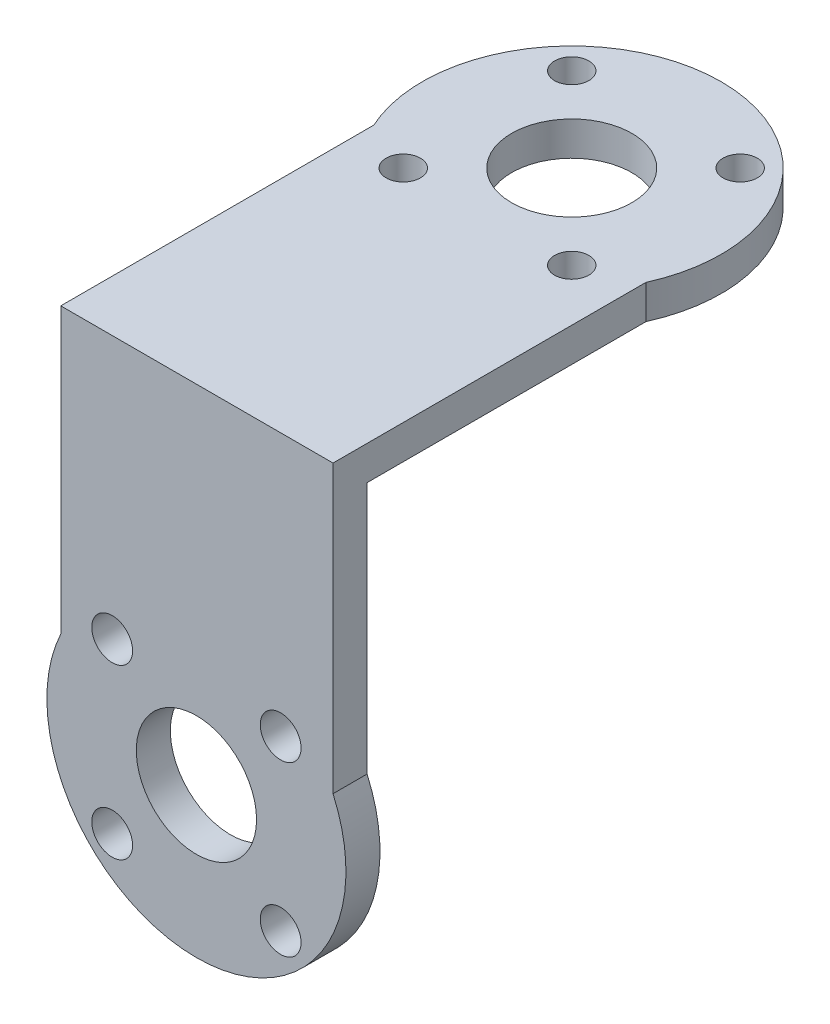
ISO-10303-21;
HEADER;
FILE_DESCRIPTION(('STEP AP214'),'2;1');
FILE_NAME('part.step','',(''),(''),'','','');
FILE_SCHEMA(('AUTOMOTIVE_DESIGN { 1 0 10303 214 1 1 1 1 }'));
ENDSEC;
DATA;
#1=APPLICATION_CONTEXT('core data for automotive mechanical design processes');
#2=APPLICATION_PROTOCOL_DEFINITION('international standard','automotive_design',2000,#1);
#3=PRODUCT_CONTEXT('',#1,'mechanical');
#4=PRODUCT('Part','Part','',(#3));
#5=PRODUCT_RELATED_PRODUCT_CATEGORY('part','',(#4));
#6=PRODUCT_DEFINITION_FORMATION('','',#4);
#7=PRODUCT_DEFINITION_CONTEXT('part definition',#1,'design');
#8=PRODUCT_DEFINITION('design','',#6,#7);
#9=PRODUCT_DEFINITION_SHAPE('','',#8);
#10=(LENGTH_UNIT() NAMED_UNIT(*) SI_UNIT(.MILLI.,.METRE.));
#11=(NAMED_UNIT(*) PLANE_ANGLE_UNIT() SI_UNIT($,.RADIAN.));
#12=(NAMED_UNIT(*) SI_UNIT($,.STERADIAN.) SOLID_ANGLE_UNIT());
#13=UNCERTAINTY_MEASURE_WITH_UNIT(LENGTH_MEASURE(1.E-05),#10,'distance_accuracy_value','');
#14=(GEOMETRIC_REPRESENTATION_CONTEXT(3) GLOBAL_UNCERTAINTY_ASSIGNED_CONTEXT((#13)) GLOBAL_UNIT_ASSIGNED_CONTEXT((#10,
#11,#12)) REPRESENTATION_CONTEXT('',''));
#15=CARTESIAN_POINT('',(0.,0.,0.));
#16=DIRECTION('',(0.,0.,1.));
#17=DIRECTION('',(1.,0.,0.));
#18=AXIS2_PLACEMENT_3D('',#15,#16,#17);
#19=CARTESIAN_POINT('',(-1.3507087548785,3.,-6.5842913704721));
#20=DIRECTION('',(0.,1.,0.));
#21=DIRECTION('',(0.,0.,1.));
#22=AXIS2_PLACEMENT_3D('',#19,#20,#21);
#23=PLANE('',#22);
#24=CARTESIAN_POINT('',(-8.77532995733724,3.,0.84032983198665));
#25=DIRECTION('',(0.,1.,0.));
#26=DIRECTION('',(0.,0.,1.));
#27=AXIS2_PLACEMENT_3D('',#24,#25,#26);
#28=CIRCLE('',#27,1.51143414703746);
#29=CARTESIAN_POINT('',(-8.77532995733724,3.,2.35176397902411));
#30=VERTEX_POINT('',#29);
#31=EDGE_CURVE('E116',#30,#30,#28,.T.);
#32=ORIENTED_EDGE('',*,*,#31,.F.);
#33=EDGE_LOOP('',(#32));
#34=FACE_BOUND('',#33,.T.);
#35=CARTESIAN_POINT('',(6.07391244758024,3.,-14.0089125729309));
#36=DIRECTION('',(0.,1.,0.));
#37=DIRECTION('',(0.,0.,1.));
#38=AXIS2_PLACEMENT_3D('',#35,#36,#37);
#39=CIRCLE('',#38,1.51143414703746);
#40=CARTESIAN_POINT('',(6.07391244758024,3.,-12.4974784258934));
#41=VERTEX_POINT('',#40);
#42=EDGE_CURVE('E105',#41,#41,#39,.T.);
#43=ORIENTED_EDGE('',*,*,#42,.F.);
#44=EDGE_LOOP('',(#43));
#45=FACE_BOUND('',#44,.T.);
#46=DIRECTION('',(0.,0.,1.));
#47=VECTOR('',#46,1.);
#48=CARTESIAN_POINT('',(-13.3507087548785,3.,23.4557086295279));
#49=LINE('',#48,#47);
#50=CARTESIAN_POINT('',(-13.3507087548785,3.,-1.13338318926047));
#51=VERTEX_POINT('',#50);
#52=CARTESIAN_POINT('',(-13.3507087548785,3.,26.4557086295279));
#53=VERTEX_POINT('',#52);
#54=EDGE_CURVE('E76',#51,#53,#49,.T.);
#55=ORIENTED_EDGE('',*,*,#54,.T.);
#56=DIRECTION('',(-1.,0.,0.));
#57=VECTOR('',#56,1.);
#58=CARTESIAN_POINT('',(10.6492912451215,3.,26.4557086295279));
#59=LINE('',#58,#57);
#60=CARTESIAN_POINT('',(10.6492912451215,3.,26.4557086295279));
#61=VERTEX_POINT('',#60);
#62=EDGE_CURVE('E180',#61,#53,#59,.T.);
#63=ORIENTED_EDGE('',*,*,#62,.F.);
#64=DIRECTION('',(0.,0.,-1.));
#65=VECTOR('',#64,1.);
#66=CARTESIAN_POINT('',(10.6492912451215,3.,23.4557086295279));
#67=LINE('',#66,#65);
#68=CARTESIAN_POINT('',(10.6492912451215,3.,-1.13338318926047));
#69=VERTEX_POINT('',#68);
#70=EDGE_CURVE('E101',#61,#69,#67,.T.);
#71=ORIENTED_EDGE('',*,*,#70,.T.);
#72=CARTESIAN_POINT('',(-1.3507087548785,3.,-6.5842913704721));
#73=DIRECTION('',(0.,1.,0.));
#74=DIRECTION('',(0.,0.,1.));
#75=AXIS2_PLACEMENT_3D('',#72,#73,#74);
#76=CIRCLE('',#75,13.18);
#77=EDGE_CURVE('E52',#69,#51,#76,.T.);
#78=ORIENTED_EDGE('',*,*,#77,.T.);
#79=EDGE_LOOP('',(#55,#63,#71,#78));
#80=FACE_BOUND('',#79,.T.);
#81=CARTESIAN_POINT('',(-1.3507087548785,3.,-6.5842913704721));
#82=DIRECTION('',(0.,1.,0.));
#83=DIRECTION('',(0.,0.,1.));
#84=AXIS2_PLACEMENT_3D('',#81,#82,#83);
#85=CIRCLE('',#84,5.3);
#86=CARTESIAN_POINT('',(-1.3507087548785,3.,-1.28429137047211));
#87=VERTEX_POINT('',#86);
#88=EDGE_CURVE('E89',#87,#87,#85,.T.);
#89=ORIENTED_EDGE('',*,*,#88,.F.);
#90=EDGE_LOOP('',(#89));
#91=FACE_BOUND('',#90,.T.);
#92=CARTESIAN_POINT('',(6.07391244758026,3.,0.840329831986619));
#93=DIRECTION('',(0.,1.,0.));
#94=DIRECTION('',(0.,0.,1.));
#95=AXIS2_PLACEMENT_3D('',#92,#93,#94);
#96=CIRCLE('',#95,1.51143414703746);
#97=CARTESIAN_POINT('',(6.07391244758026,3.,2.35176397902408));
#98=VERTEX_POINT('',#97);
#99=EDGE_CURVE('E110',#98,#98,#96,.T.);
#100=ORIENTED_EDGE('',*,*,#99,.F.);
#101=EDGE_LOOP('',(#100));
#102=FACE_BOUND('',#101,.T.);
#103=CARTESIAN_POINT('',(-8.77532995733726,3.,-14.0089125729308));
#104=DIRECTION('',(0.,1.,0.));
#105=DIRECTION('',(0.,0.,1.));
#106=AXIS2_PLACEMENT_3D('',#103,#104,#105);
#107=CIRCLE('',#106,1.51143414703746);
#108=CARTESIAN_POINT('',(-8.77532995733726,3.,-12.4974784258934));
#109=VERTEX_POINT('',#108);
#110=EDGE_CURVE('E122',#109,#109,#107,.T.);
#111=ORIENTED_EDGE('',*,*,#110,.F.);
#112=EDGE_LOOP('',(#111));
#113=FACE_BOUND('',#112,.T.);
#114=ADVANCED_FACE('F33',(#34,#45,#80,#91,#102,#113),#23,.T.);
#115=CARTESIAN_POINT('',(-1.3507087548785,0.,-6.5842913704721));
#116=DIRECTION('',(0.,1.,0.));
#117=DIRECTION('',(0.,0.,1.));
#118=AXIS2_PLACEMENT_3D('',#115,#116,#117);
#119=PLANE('',#118);
#120=CARTESIAN_POINT('',(-8.77532995733724,0.,0.84032983198665));
#121=DIRECTION('',(0.,1.,0.));
#122=DIRECTION('',(0.,0.,1.));
#123=AXIS2_PLACEMENT_3D('',#120,#121,#122);
#124=CIRCLE('',#123,1.51143414703746);
#125=CARTESIAN_POINT('',(-8.77532995733724,0.,2.35176397902411));
#126=VERTEX_POINT('',#125);
#127=EDGE_CURVE('E119',#126,#126,#124,.T.);
#128=ORIENTED_EDGE('',*,*,#127,.T.);
#129=EDGE_LOOP('',(#128));
#130=FACE_BOUND('',#129,.T.);
#131=CARTESIAN_POINT('',(6.07391244758024,0.,-14.0089125729309));
#132=DIRECTION('',(0.,1.,0.));
#133=DIRECTION('',(0.,0.,1.));
#134=AXIS2_PLACEMENT_3D('',#131,#132,#133);
#135=CIRCLE('',#134,1.51143414703746);
#136=CARTESIAN_POINT('',(6.07391244758024,0.,-12.4974784258934));
#137=VERTEX_POINT('',#136);
#138=EDGE_CURVE('E107',#137,#137,#135,.T.);
#139=ORIENTED_EDGE('',*,*,#138,.T.);
#140=EDGE_LOOP('',(#139));
#141=FACE_BOUND('',#140,.T.);
#142=DIRECTION('',(0.,0.,1.));
#143=VECTOR('',#142,1.);
#144=CARTESIAN_POINT('',(-13.3507087548785,0.,23.4557086295279));
#145=LINE('',#144,#143);
#146=CARTESIAN_POINT('',(-13.3507087548785,0.,-1.13338318926047));
#147=VERTEX_POINT('',#146);
#148=CARTESIAN_POINT('',(-13.3507087548785,0.,23.4557086295279));
#149=VERTEX_POINT('',#148);
#150=EDGE_CURVE('E81',#147,#149,#145,.T.);
#151=ORIENTED_EDGE('',*,*,#150,.F.);
#152=CARTESIAN_POINT('',(-1.3507087548785,0.,-6.5842913704721));
#153=DIRECTION('',(0.,1.,0.));
#154=DIRECTION('',(0.,0.,1.));
#155=AXIS2_PLACEMENT_3D('',#152,#153,#154);
#156=CIRCLE('',#155,13.18);
#157=CARTESIAN_POINT('',(10.6492912451215,0.,-1.13338318926047));
#158=VERTEX_POINT('',#157);
#159=EDGE_CURVE('E70',#158,#147,#156,.T.);
#160=ORIENTED_EDGE('',*,*,#159,.F.);
#161=DIRECTION('',(0.,0.,-1.));
#162=VECTOR('',#161,1.);
#163=CARTESIAN_POINT('',(10.6492912451215,0.,23.4557086295279));
#164=LINE('',#163,#162);
#165=CARTESIAN_POINT('',(10.6492912451215,0.,23.4557086295279));
#166=VERTEX_POINT('',#165);
#167=EDGE_CURVE('E66',#166,#158,#164,.T.);
#168=ORIENTED_EDGE('',*,*,#167,.F.);
#169=DIRECTION('',(1.,0.,0.));
#170=VECTOR('',#169,1.);
#171=CARTESIAN_POINT('',(-13.3507087548785,0.,23.4557086295279));
#172=LINE('',#171,#170);
#173=EDGE_CURVE('E88',#149,#166,#172,.T.);
#174=ORIENTED_EDGE('',*,*,#173,.F.);
#175=EDGE_LOOP('',(#151,#160,#168,#174));
#176=FACE_BOUND('',#175,.T.);
#177=CARTESIAN_POINT('',(-1.3507087548785,0.,-6.5842913704721));
#178=DIRECTION('',(0.,1.,0.));
#179=DIRECTION('',(0.,0.,1.));
#180=AXIS2_PLACEMENT_3D('',#177,#178,#179);
#181=CIRCLE('',#180,5.3);
#182=CARTESIAN_POINT('',(-1.3507087548785,0.,-1.28429137047211));
#183=VERTEX_POINT('',#182);
#184=EDGE_CURVE('E92',#183,#183,#181,.T.);
#185=ORIENTED_EDGE('',*,*,#184,.T.);
#186=EDGE_LOOP('',(#185));
#187=FACE_BOUND('',#186,.T.);
#188=CARTESIAN_POINT('',(6.07391244758026,0.,0.840329831986619));
#189=DIRECTION('',(0.,1.,0.));
#190=DIRECTION('',(0.,0.,1.));
#191=AXIS2_PLACEMENT_3D('',#188,#189,#190);
#192=CIRCLE('',#191,1.51143414703746);
#193=CARTESIAN_POINT('',(6.07391244758026,0.,2.35176397902408));
#194=VERTEX_POINT('',#193);
#195=EDGE_CURVE('E113',#194,#194,#192,.T.);
#196=ORIENTED_EDGE('',*,*,#195,.T.);
#197=EDGE_LOOP('',(#196));
#198=FACE_BOUND('',#197,.T.);
#199=CARTESIAN_POINT('',(-8.77532995733726,0.,-14.0089125729308));
#200=DIRECTION('',(0.,1.,0.));
#201=DIRECTION('',(0.,0.,1.));
#202=AXIS2_PLACEMENT_3D('',#199,#200,#201);
#203=CIRCLE('',#202,1.51143414703746);
#204=CARTESIAN_POINT('',(-8.77532995733726,0.,-12.4974784258934));
#205=VERTEX_POINT('',#204);
#206=EDGE_CURVE('E125',#205,#205,#203,.T.);
#207=ORIENTED_EDGE('',*,*,#206,.T.);
#208=EDGE_LOOP('',(#207));
#209=FACE_BOUND('',#208,.T.);
#210=ADVANCED_FACE('F85',(#130,#141,#176,#187,#198,#209),#119,.F.);
#211=CARTESIAN_POINT('',(-13.3507087548785,3.,23.4557086295279));
#212=DIRECTION('',(1.,0.,0.));
#213=DIRECTION('',(0.,0.,-1.));
#214=AXIS2_PLACEMENT_3D('',#211,#212,#213);
#215=PLANE('',#214);
#216=ORIENTED_EDGE('',*,*,#150,.T.);
#217=DIRECTION('',(0.,-1.,0.));
#218=VECTOR('',#217,1.);
#219=CARTESIAN_POINT('',(-13.3507087548785,3.,23.4557086295279));
#220=LINE('',#219,#218);
#221=CARTESIAN_POINT('',(-13.3507087548785,-22.0572356790139,23.4557086295279));
#222=VERTEX_POINT('',#221);
#223=EDGE_CURVE('E131',#149,#222,#220,.T.);
#224=ORIENTED_EDGE('',*,*,#223,.T.);
#225=DIRECTION('',(0.,0.,-1.));
#226=VECTOR('',#225,1.);
#227=CARTESIAN_POINT('',(-13.3507087548785,-22.0572356790139,26.4557086295279));
#228=LINE('',#227,#226);
#229=CARTESIAN_POINT('',(-13.3507087548785,-22.0572356790139,26.4557086295279));
#230=VERTEX_POINT('',#229);
#231=EDGE_CURVE('E128',#230,#222,#228,.T.);
#232=ORIENTED_EDGE('',*,*,#231,.F.);
#233=DIRECTION('',(0.,-1.,0.));
#234=VECTOR('',#233,1.);
#235=CARTESIAN_POINT('',(-13.3507087548785,3.,26.4557086295279));
#236=LINE('',#235,#234);
#237=EDGE_CURVE('E183',#53,#230,#236,.T.);
#238=ORIENTED_EDGE('',*,*,#237,.F.);
#239=ORIENTED_EDGE('',*,*,#54,.F.);
#240=DIRECTION('',(0.,-1.,0.));
#241=VECTOR('',#240,1.);
#242=CARTESIAN_POINT('',(-13.3507087548785,3.,-1.13338318926047));
#243=LINE('',#242,#241);
#244=EDGE_CURVE('E43',#51,#147,#243,.T.);
#245=ORIENTED_EDGE('',*,*,#244,.T.);
#246=EDGE_LOOP('',(#216,#224,#232,#238,#239,#245));
#247=FACE_BOUND('',#246,.T.);
#248=ADVANCED_FACE('F35',(#247),#215,.F.);
#249=CARTESIAN_POINT('',(10.6492912451215,3.,23.4557086295279));
#250=DIRECTION('',(-1.,0.,0.));
#251=DIRECTION('',(0.,0.,1.));
#252=AXIS2_PLACEMENT_3D('',#249,#250,#251);
#253=PLANE('',#252);
#254=ORIENTED_EDGE('',*,*,#167,.T.);
#255=DIRECTION('',(0.,-1.,0.));
#256=VECTOR('',#255,1.);
#257=CARTESIAN_POINT('',(10.6492912451215,3.,-1.13338318926047));
#258=LINE('',#257,#256);
#259=EDGE_CURVE('E11',#69,#158,#258,.T.);
#260=ORIENTED_EDGE('',*,*,#259,.F.);
#261=ORIENTED_EDGE('',*,*,#70,.F.);
#262=DIRECTION('',(0.,1.,0.));
#263=VECTOR('',#262,1.);
#264=CARTESIAN_POINT('',(10.6492912451215,3.,26.4557086295279));
#265=LINE('',#264,#263);
#266=CARTESIAN_POINT('',(10.6492912451215,-22.2428542724903,26.4557086295279));
#267=VERTEX_POINT('',#266);
#268=EDGE_CURVE('E144',#267,#61,#265,.T.);
#269=ORIENTED_EDGE('',*,*,#268,.F.);
#270=DIRECTION('',(0.,0.,-1.));
#271=VECTOR('',#270,1.);
#272=CARTESIAN_POINT('',(10.6492912451215,-22.2428542724903,26.4557086295279));
#273=LINE('',#272,#271);
#274=CARTESIAN_POINT('',(10.6492912451215,-22.2428542724903,23.4557086295279));
#275=VERTEX_POINT('',#274);
#276=EDGE_CURVE('E145',#267,#275,#273,.T.);
#277=ORIENTED_EDGE('',*,*,#276,.T.);
#278=DIRECTION('',(0.,1.,0.));
#279=VECTOR('',#278,1.);
#280=CARTESIAN_POINT('',(10.6492912451215,3.,23.4557086295279));
#281=LINE('',#280,#279);
#282=EDGE_CURVE('E135',#275,#166,#281,.T.);
#283=ORIENTED_EDGE('',*,*,#282,.T.);
#284=EDGE_LOOP('',(#254,#260,#261,#269,#277,#283));
#285=FACE_BOUND('',#284,.T.);
#286=ADVANCED_FACE('F192',(#285),#253,.F.);
#287=CARTESIAN_POINT('',(-1.3507087548785,3.,-6.5842913704721));
#288=DIRECTION('',(0.,-1.,0.));
#289=DIRECTION('',(0.,0.,-1.));
#290=AXIS2_PLACEMENT_3D('',#287,#288,#289);
#291=CYLINDRICAL_SURFACE('',#290,13.18);
#292=ORIENTED_EDGE('',*,*,#159,.T.);
#293=ORIENTED_EDGE('',*,*,#244,.F.);
#294=ORIENTED_EDGE('',*,*,#77,.F.);
#295=ORIENTED_EDGE('',*,*,#259,.T.);
#296=EDGE_LOOP('',(#292,#293,#294,#295));
#297=FACE_BOUND('',#296,.T.);
#298=ADVANCED_FACE('F72',(#297),#291,.T.);
#299=CARTESIAN_POINT('',(-1.3507087548785,3.,-6.5842913704721));
#300=DIRECTION('',(0.,-1.,0.));
#301=DIRECTION('',(0.,0.,-1.));
#302=AXIS2_PLACEMENT_3D('',#299,#300,#301);
#303=CYLINDRICAL_SURFACE('',#302,5.3);
#304=ORIENTED_EDGE('',*,*,#88,.T.);
#305=EDGE_LOOP('',(#304));
#306=FACE_BOUND('',#305,.T.);
#307=ORIENTED_EDGE('',*,*,#184,.F.);
#308=EDGE_LOOP('',(#307));
#309=FACE_BOUND('',#308,.T.);
#310=ADVANCED_FACE('F225',(#306,#309),#303,.F.);
#311=CARTESIAN_POINT('',(6.07391244758024,3.,-14.0089125729309));
#312=DIRECTION('',(0.,-1.,0.));
#313=DIRECTION('',(0.,0.,-1.));
#314=AXIS2_PLACEMENT_3D('',#311,#312,#313);
#315=CYLINDRICAL_SURFACE('',#314,1.51143414703746);
#316=ORIENTED_EDGE('',*,*,#42,.T.);
#317=EDGE_LOOP('',(#316));
#318=FACE_BOUND('',#317,.T.);
#319=ORIENTED_EDGE('',*,*,#138,.F.);
#320=EDGE_LOOP('',(#319));
#321=FACE_BOUND('',#320,.T.);
#322=ADVANCED_FACE('F242',(#318,#321),#315,.F.);
#323=CARTESIAN_POINT('',(6.07391244758026,3.,0.840329831986619));
#324=DIRECTION('',(0.,-1.,0.));
#325=DIRECTION('',(0.,0.,-1.));
#326=AXIS2_PLACEMENT_3D('',#323,#324,#325);
#327=CYLINDRICAL_SURFACE('',#326,1.51143414703746);
#328=ORIENTED_EDGE('',*,*,#99,.T.);
#329=EDGE_LOOP('',(#328));
#330=FACE_BOUND('',#329,.T.);
#331=ORIENTED_EDGE('',*,*,#195,.F.);
#332=EDGE_LOOP('',(#331));
#333=FACE_BOUND('',#332,.T.);
#334=ADVANCED_FACE('F249',(#330,#333),#327,.F.);
#335=CARTESIAN_POINT('',(-8.77532995733724,3.,0.84032983198665));
#336=DIRECTION('',(0.,-1.,0.));
#337=DIRECTION('',(0.,0.,-1.));
#338=AXIS2_PLACEMENT_3D('',#335,#336,#337);
#339=CYLINDRICAL_SURFACE('',#338,1.51143414703746);
#340=ORIENTED_EDGE('',*,*,#31,.T.);
#341=EDGE_LOOP('',(#340));
#342=FACE_BOUND('',#341,.T.);
#343=ORIENTED_EDGE('',*,*,#127,.F.);
#344=EDGE_LOOP('',(#343));
#345=FACE_BOUND('',#344,.T.);
#346=ADVANCED_FACE('F211',(#342,#345),#339,.F.);
#347=CARTESIAN_POINT('',(-8.77532995733726,3.,-14.0089125729308));
#348=DIRECTION('',(0.,-1.,0.));
#349=DIRECTION('',(0.,0.,-1.));
#350=AXIS2_PLACEMENT_3D('',#347,#348,#349);
#351=CYLINDRICAL_SURFACE('',#350,1.51143414703746);
#352=ORIENTED_EDGE('',*,*,#110,.T.);
#353=EDGE_LOOP('',(#352));
#354=FACE_BOUND('',#353,.T.);
#355=ORIENTED_EDGE('',*,*,#206,.F.);
#356=EDGE_LOOP('',(#355));
#357=FACE_BOUND('',#356,.T.);
#358=ADVANCED_FACE('F208',(#354,#357),#351,.F.);
#359=CARTESIAN_POINT('',(-1.39285929596644,-27.6,23.4557086295279));
#360=DIRECTION('',(0.,0.,1.));
#361=DIRECTION('',(1.,0.,0.));
#362=AXIS2_PLACEMENT_3D('',#359,#360,#361);
#363=PLANE('',#362);
#364=CARTESIAN_POINT('',(6.03176190649232,-35.0246212024587,23.4557086295279));
#365=DIRECTION('',(0.,0.,1.));
#366=DIRECTION('',(1.,0.,0.));
#367=AXIS2_PLACEMENT_3D('',#364,#365,#366);
#368=CIRCLE('',#367,1.8);
#369=CARTESIAN_POINT('',(7.83176190649232,-35.0246212024587,23.4557086295279));
#370=VERTEX_POINT('',#369);
#371=EDGE_CURVE('E388',#370,#370,#368,.T.);
#372=ORIENTED_EDGE('',*,*,#371,.T.);
#373=EDGE_LOOP('',(#372));
#374=FACE_BOUND('',#373,.T.);
#375=CARTESIAN_POINT('',(-8.8174804984252,-20.1753787975413,23.4557086295279));
#376=DIRECTION('',(0.,0.,1.));
#377=DIRECTION('',(1.,0.,0.));
#378=AXIS2_PLACEMENT_3D('',#375,#376,#377);
#379=CIRCLE('',#378,1.80000000000001);
#380=CARTESIAN_POINT('',(-7.0174804984252,-20.1753787975413,23.4557086295279));
#381=VERTEX_POINT('',#380);
#382=EDGE_CURVE('E396',#381,#381,#379,.T.);
#383=ORIENTED_EDGE('',*,*,#382,.T.);
#384=EDGE_LOOP('',(#383));
#385=FACE_BOUND('',#384,.T.);
#386=CARTESIAN_POINT('',(-1.39285929596644,-27.6,23.4557086295279));
#387=DIRECTION('',(0.,0.,1.));
#388=DIRECTION('',(1.,0.,0.));
#389=AXIS2_PLACEMENT_3D('',#386,#387,#388);
#390=CIRCLE('',#389,5.3);
#391=CARTESIAN_POINT('',(3.90714070403355,-27.6,23.4557086295279));
#392=VERTEX_POINT('',#391);
#393=EDGE_CURVE('E167',#392,#392,#390,.T.);
#394=ORIENTED_EDGE('',*,*,#393,.T.);
#395=EDGE_LOOP('',(#394));
#396=FACE_BOUND('',#395,.T.);
#397=CARTESIAN_POINT('',(-8.81748049842518,-35.0246212024588,23.4557086295279));
#398=DIRECTION('',(0.,0.,1.));
#399=DIRECTION('',(1.,0.,0.));
#400=AXIS2_PLACEMENT_3D('',#397,#398,#399);
#401=CIRCLE('',#400,1.8);
#402=CARTESIAN_POINT('',(-7.01748049842517,-35.0246212024588,23.4557086295279));
#403=VERTEX_POINT('',#402);
#404=EDGE_CURVE('E175',#403,#403,#401,.T.);
#405=ORIENTED_EDGE('',*,*,#404,.T.);
#406=EDGE_LOOP('',(#405));
#407=FACE_BOUND('',#406,.T.);
#408=CARTESIAN_POINT('',(6.03176190649229,-20.1753787975412,23.4557086295279));
#409=DIRECTION('',(0.,0.,1.));
#410=DIRECTION('',(1.,0.,0.));
#411=AXIS2_PLACEMENT_3D('',#408,#409,#410);
#412=CIRCLE('',#411,1.8);
#413=CARTESIAN_POINT('',(7.83176190649229,-20.1753787975412,23.4557086295279));
#414=VERTEX_POINT('',#413);
#415=EDGE_CURVE('E390',#414,#414,#412,.T.);
#416=ORIENTED_EDGE('',*,*,#415,.T.);
#417=EDGE_LOOP('',(#416));
#418=FACE_BOUND('',#417,.T.);
#419=ORIENTED_EDGE('',*,*,#223,.F.);
#420=ORIENTED_EDGE('',*,*,#173,.T.);
#421=ORIENTED_EDGE('',*,*,#282,.F.);
#422=CARTESIAN_POINT('',(-1.39285929596644,-27.6,23.4557086295279));
#423=DIRECTION('',(0.,0.,1.));
#424=DIRECTION('',(1.,0.,0.));
#425=AXIS2_PLACEMENT_3D('',#422,#423,#424);
#426=CIRCLE('',#425,13.18);
#427=EDGE_CURVE('E134',#222,#275,#426,.T.);
#428=ORIENTED_EDGE('',*,*,#427,.F.);
#429=EDGE_LOOP('',(#419,#420,#421,#428));
#430=FACE_BOUND('',#429,.T.);
#431=ADVANCED_FACE('F162',(#374,#385,#396,#407,#418,#430),#363,.F.);
#432=CARTESIAN_POINT('',(-1.39285929596644,-27.6,26.4557086295279));
#433=DIRECTION('',(0.,0.,1.));
#434=DIRECTION('',(1.,0.,0.));
#435=AXIS2_PLACEMENT_3D('',#432,#433,#434);
#436=PLANE('',#435);
#437=CARTESIAN_POINT('',(6.03176190649229,-20.1753787975412,26.4557086295279));
#438=DIRECTION('',(0.,0.,1.));
#439=DIRECTION('',(1.,0.,0.));
#440=AXIS2_PLACEMENT_3D('',#437,#438,#439);
#441=CIRCLE('',#440,1.8);
#442=CARTESIAN_POINT('',(7.83176190649229,-20.1753787975412,26.4557086295279));
#443=VERTEX_POINT('',#442);
#444=EDGE_CURVE('E393',#443,#443,#441,.T.);
#445=ORIENTED_EDGE('',*,*,#444,.F.);
#446=EDGE_LOOP('',(#445));
#447=FACE_BOUND('',#446,.T.);
#448=CARTESIAN_POINT('',(-8.81748049842518,-35.0246212024588,26.4557086295279));
#449=DIRECTION('',(0.,0.,1.));
#450=DIRECTION('',(1.,0.,0.));
#451=AXIS2_PLACEMENT_3D('',#448,#449,#450);
#452=CIRCLE('',#451,1.8);
#453=CARTESIAN_POINT('',(-7.01748049842517,-35.0246212024588,26.4557086295279));
#454=VERTEX_POINT('',#453);
#455=EDGE_CURVE('E172',#454,#454,#452,.T.);
#456=ORIENTED_EDGE('',*,*,#455,.F.);
#457=EDGE_LOOP('',(#456));
#458=FACE_BOUND('',#457,.T.);
#459=ORIENTED_EDGE('',*,*,#268,.T.);
#460=ORIENTED_EDGE('',*,*,#62,.T.);
#461=ORIENTED_EDGE('',*,*,#237,.T.);
#462=CARTESIAN_POINT('',(-1.39285929596644,-27.6,26.4557086295279));
#463=DIRECTION('',(0.,0.,1.));
#464=DIRECTION('',(1.,0.,0.));
#465=AXIS2_PLACEMENT_3D('',#462,#463,#464);
#466=CIRCLE('',#465,13.18);
#467=EDGE_CURVE('E147',#230,#267,#466,.T.);
#468=ORIENTED_EDGE('',*,*,#467,.T.);
#469=EDGE_LOOP('',(#459,#460,#461,#468));
#470=FACE_BOUND('',#469,.T.);
#471=CARTESIAN_POINT('',(-1.39285929596644,-27.6,26.4557086295279));
#472=DIRECTION('',(0.,0.,1.));
#473=DIRECTION('',(1.,0.,0.));
#474=AXIS2_PLACEMENT_3D('',#471,#472,#473);
#475=CIRCLE('',#474,5.3);
#476=CARTESIAN_POINT('',(3.90714070403355,-27.6,26.4557086295279));
#477=VERTEX_POINT('',#476);
#478=EDGE_CURVE('E165',#477,#477,#475,.T.);
#479=ORIENTED_EDGE('',*,*,#478,.F.);
#480=EDGE_LOOP('',(#479));
#481=FACE_BOUND('',#480,.T.);
#482=CARTESIAN_POINT('',(-8.8174804984252,-20.1753787975413,26.4557086295279));
#483=DIRECTION('',(0.,0.,1.));
#484=DIRECTION('',(1.,0.,0.));
#485=AXIS2_PLACEMENT_3D('',#482,#483,#484);
#486=CIRCLE('',#485,1.80000000000001);
#487=CARTESIAN_POINT('',(-7.0174804984252,-20.1753787975413,26.4557086295279));
#488=VERTEX_POINT('',#487);
#489=EDGE_CURVE('E399',#488,#488,#486,.T.);
#490=ORIENTED_EDGE('',*,*,#489,.F.);
#491=EDGE_LOOP('',(#490));
#492=FACE_BOUND('',#491,.T.);
#493=CARTESIAN_POINT('',(6.03176190649232,-35.0246212024587,26.4557086295279));
#494=DIRECTION('',(0.,0.,1.));
#495=DIRECTION('',(1.,0.,0.));
#496=AXIS2_PLACEMENT_3D('',#493,#494,#495);
#497=CIRCLE('',#496,1.8);
#498=CARTESIAN_POINT('',(7.83176190649232,-35.0246212024587,26.4557086295279));
#499=VERTEX_POINT('',#498);
#500=EDGE_CURVE('E385',#499,#499,#497,.T.);
#501=ORIENTED_EDGE('',*,*,#500,.F.);
#502=EDGE_LOOP('',(#501));
#503=FACE_BOUND('',#502,.T.);
#504=ADVANCED_FACE('F187',(#447,#458,#470,#481,#492,#503),#436,.T.);
#505=CARTESIAN_POINT('',(-1.39285929596644,-27.6,26.4557086295279));
#506=DIRECTION('',(0.,0.,-1.));
#507=DIRECTION('',(-1.,0.,0.));
#508=AXIS2_PLACEMENT_3D('',#505,#506,#507);
#509=CYLINDRICAL_SURFACE('',#508,13.18);
#510=ORIENTED_EDGE('',*,*,#427,.T.);
#511=ORIENTED_EDGE('',*,*,#276,.F.);
#512=ORIENTED_EDGE('',*,*,#467,.F.);
#513=ORIENTED_EDGE('',*,*,#231,.T.);
#514=EDGE_LOOP('',(#510,#511,#512,#513));
#515=FACE_BOUND('',#514,.T.);
#516=ADVANCED_FACE('F154',(#515),#509,.T.);
#517=CARTESIAN_POINT('',(-1.39285929596644,-27.6,26.4557086295279));
#518=DIRECTION('',(0.,0.,-1.));
#519=DIRECTION('',(-1.,0.,0.));
#520=AXIS2_PLACEMENT_3D('',#517,#518,#519);
#521=CYLINDRICAL_SURFACE('',#520,5.3);
#522=ORIENTED_EDGE('',*,*,#478,.T.);
#523=EDGE_LOOP('',(#522));
#524=FACE_BOUND('',#523,.T.);
#525=ORIENTED_EDGE('',*,*,#393,.F.);
#526=EDGE_LOOP('',(#525));
#527=FACE_BOUND('',#526,.T.);
#528=ADVANCED_FACE('F289',(#524,#527),#521,.F.);
#529=CARTESIAN_POINT('',(-8.81748049842518,-35.0246212024588,26.4557086295279));
#530=DIRECTION('',(0.,0.,-1.));
#531=DIRECTION('',(-1.,0.,0.));
#532=AXIS2_PLACEMENT_3D('',#529,#530,#531);
#533=CYLINDRICAL_SURFACE('',#532,1.8);
#534=ORIENTED_EDGE('',*,*,#455,.T.);
#535=EDGE_LOOP('',(#534));
#536=FACE_BOUND('',#535,.T.);
#537=ORIENTED_EDGE('',*,*,#404,.F.);
#538=EDGE_LOOP('',(#537));
#539=FACE_BOUND('',#538,.T.);
#540=ADVANCED_FACE('F296',(#536,#539),#533,.F.);
#541=CARTESIAN_POINT('',(-8.8174804984252,-20.1753787975413,26.4557086295279));
#542=DIRECTION('',(0.,0.,-1.));
#543=DIRECTION('',(-1.,0.,0.));
#544=AXIS2_PLACEMENT_3D('',#541,#542,#543);
#545=CYLINDRICAL_SURFACE('',#544,1.80000000000001);
#546=ORIENTED_EDGE('',*,*,#489,.T.);
#547=EDGE_LOOP('',(#546));
#548=FACE_BOUND('',#547,.T.);
#549=ORIENTED_EDGE('',*,*,#382,.F.);
#550=EDGE_LOOP('',(#549));
#551=FACE_BOUND('',#550,.T.);
#552=ADVANCED_FACE('F303',(#548,#551),#545,.F.);
#553=CARTESIAN_POINT('',(6.03176190649229,-20.1753787975412,26.4557086295279));
#554=DIRECTION('',(0.,0.,-1.));
#555=DIRECTION('',(-1.,0.,0.));
#556=AXIS2_PLACEMENT_3D('',#553,#554,#555);
#557=CYLINDRICAL_SURFACE('',#556,1.8);
#558=ORIENTED_EDGE('',*,*,#444,.T.);
#559=EDGE_LOOP('',(#558));
#560=FACE_BOUND('',#559,.T.);
#561=ORIENTED_EDGE('',*,*,#415,.F.);
#562=EDGE_LOOP('',(#561));
#563=FACE_BOUND('',#562,.T.);
#564=ADVANCED_FACE('F311',(#560,#563),#557,.F.);
#565=CARTESIAN_POINT('',(6.03176190649232,-35.0246212024587,26.4557086295279));
#566=DIRECTION('',(0.,0.,-1.));
#567=DIRECTION('',(-1.,0.,0.));
#568=AXIS2_PLACEMENT_3D('',#565,#566,#567);
#569=CYLINDRICAL_SURFACE('',#568,1.8);
#570=ORIENTED_EDGE('',*,*,#500,.T.);
#571=EDGE_LOOP('',(#570));
#572=FACE_BOUND('',#571,.T.);
#573=ORIENTED_EDGE('',*,*,#371,.F.);
#574=EDGE_LOOP('',(#573));
#575=FACE_BOUND('',#574,.T.);
#576=ADVANCED_FACE('F319',(#572,#575),#569,.F.);
#577=CLOSED_SHELL('',(#114,#210,#248,#286,#298,#310,#322,#334,#346,#358,#431,#504,#516,#528,
#540,#552,#564,#576));
#578=MANIFOLD_SOLID_BREP('B2',#577);
#579=ADVANCED_BREP_SHAPE_REPRESENTATION('',(#18,#578),#14);
#580=SHAPE_DEFINITION_REPRESENTATION(#9,#579);
ENDSEC;
END-ISO-10303-21;
